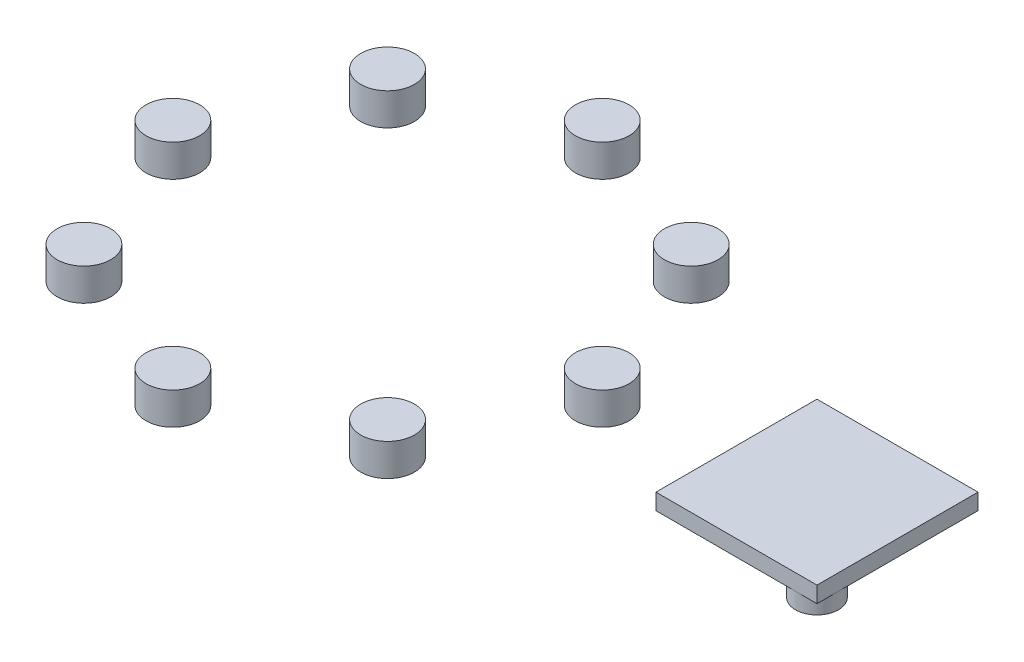
ISO-10303-21;
HEADER;
FILE_DESCRIPTION(('STEP AP214'),'2;1');
FILE_NAME('part.step','',(''),(''),'','','');
FILE_SCHEMA(('AUTOMOTIVE_DESIGN { 1 0 10303 214 1 1 1 1 }'));
ENDSEC;
DATA;
#1=APPLICATION_CONTEXT('core data for automotive mechanical design processes');
#2=APPLICATION_PROTOCOL_DEFINITION('international standard','automotive_design',2000,#1);
#3=PRODUCT_CONTEXT('',#1,'mechanical');
#4=PRODUCT('Part','Part','',(#3));
#5=PRODUCT_RELATED_PRODUCT_CATEGORY('part','',(#4));
#6=PRODUCT_DEFINITION_FORMATION('','',#4);
#7=PRODUCT_DEFINITION_CONTEXT('part definition',#1,'design');
#8=PRODUCT_DEFINITION('design','',#6,#7);
#9=PRODUCT_DEFINITION_SHAPE('','',#8);
#10=(LENGTH_UNIT() NAMED_UNIT(*) SI_UNIT(.MILLI.,.METRE.));
#11=(NAMED_UNIT(*) PLANE_ANGLE_UNIT() SI_UNIT($,.RADIAN.));
#12=(NAMED_UNIT(*) SI_UNIT($,.STERADIAN.) SOLID_ANGLE_UNIT());
#13=UNCERTAINTY_MEASURE_WITH_UNIT(LENGTH_MEASURE(1.E-05),#10,'distance_accuracy_value','');
#14=(GEOMETRIC_REPRESENTATION_CONTEXT(3) GLOBAL_UNCERTAINTY_ASSIGNED_CONTEXT((#13)) GLOBAL_UNIT_ASSIGNED_CONTEXT((#10,
#11,#12)) REPRESENTATION_CONTEXT('',''));
#15=CARTESIAN_POINT('',(0.,0.,0.));
#16=DIRECTION('',(0.,0.,1.));
#17=DIRECTION('',(1.,0.,0.));
#18=AXIS2_PLACEMENT_3D('',#15,#16,#17);
#19=CARTESIAN_POINT('',(-29.1421356237309,3.,14.142135623731));
#20=DIRECTION('',(0.,-1.,0.));
#21=DIRECTION('',(0.,0.,-1.));
#22=AXIS2_PLACEMENT_3D('',#19,#20,#21);
#23=CYLINDRICAL_SURFACE('',#22,2.49999999999999);
#24=CARTESIAN_POINT('',(-29.1421356237309,3.,14.142135623731));
#25=DIRECTION('',(0.,1.,0.));
#26=DIRECTION('',(0.,0.,1.));
#27=AXIS2_PLACEMENT_3D('',#24,#25,#26);
#28=CIRCLE('',#27,2.49999999999999);
#29=CARTESIAN_POINT('',(-29.1421356237309,3.,16.642135623731));
#30=VERTEX_POINT('',#29);
#31=EDGE_CURVE('E79',#30,#30,#28,.T.);
#32=ORIENTED_EDGE('',*,*,#31,.F.);
#33=EDGE_LOOP('',(#32));
#34=FACE_BOUND('',#33,.T.);
#35=CARTESIAN_POINT('',(-29.1421356237309,0.,14.142135623731));
#36=DIRECTION('',(0.,1.,0.));
#37=DIRECTION('',(0.,0.,1.));
#38=AXIS2_PLACEMENT_3D('',#35,#36,#37);
#39=CIRCLE('',#38,2.49999999999999);
#40=CARTESIAN_POINT('',(-29.1421356237309,0.,16.642135623731));
#41=VERTEX_POINT('',#40);
#42=EDGE_CURVE('E12',#41,#41,#39,.T.);
#43=ORIENTED_EDGE('',*,*,#42,.T.);
#44=EDGE_LOOP('',(#43));
#45=FACE_BOUND('',#44,.T.);
#46=ADVANCED_FACE('F75',(#34,#45),#23,.T.);
#47=CARTESIAN_POINT('',(-29.1421356237309,3.,14.142135623731));
#48=DIRECTION('',(0.,1.,0.));
#49=DIRECTION('',(0.,0.,1.));
#50=AXIS2_PLACEMENT_3D('',#47,#48,#49);
#51=PLANE('',#50);
#52=ORIENTED_EDGE('',*,*,#31,.T.);
#53=EDGE_LOOP('',(#52));
#54=FACE_BOUND('',#53,.T.);
#55=ADVANCED_FACE('F77',(#54),#51,.T.);
#56=CARTESIAN_POINT('',(-29.1421356237309,0.,14.142135623731));
#57=DIRECTION('',(0.,1.,0.));
#58=DIRECTION('',(0.,0.,1.));
#59=AXIS2_PLACEMENT_3D('',#56,#57,#58);
#60=PLANE('',#59);
#61=ORIENTED_EDGE('',*,*,#42,.F.);
#62=EDGE_LOOP('',(#61));
#63=FACE_BOUND('',#62,.T.);
#64=ADVANCED_FACE('F94',(#63),#60,.F.);
#65=CLOSED_SHELL('',(#46,#55,#64));
#66=MANIFOLD_SOLID_BREP('B2',#65);
#67=CARTESIAN_POINT('',(-15.,3.,20.));
#68=DIRECTION('',(0.,-1.,0.));
#69=DIRECTION('',(0.,0.,-1.));
#70=AXIS2_PLACEMENT_3D('',#67,#68,#69);
#71=CYLINDRICAL_SURFACE('',#70,2.49999999999999);
#72=CARTESIAN_POINT('',(-15.,3.,20.));
#73=DIRECTION('',(0.,1.,0.));
#74=DIRECTION('',(0.,0.,1.));
#75=AXIS2_PLACEMENT_3D('',#72,#73,#74);
#76=CIRCLE('',#75,2.49999999999999);
#77=CARTESIAN_POINT('',(-15.,3.,22.5));
#78=VERTEX_POINT('',#77);
#79=EDGE_CURVE('E128',#78,#78,#76,.T.);
#80=ORIENTED_EDGE('',*,*,#79,.F.);
#81=EDGE_LOOP('',(#80));
#82=FACE_BOUND('',#81,.T.);
#83=CARTESIAN_POINT('',(-15.,0.,20.));
#84=DIRECTION('',(0.,1.,0.));
#85=DIRECTION('',(0.,0.,1.));
#86=AXIS2_PLACEMENT_3D('',#83,#84,#85);
#87=CIRCLE('',#86,2.49999999999999);
#88=CARTESIAN_POINT('',(-15.,0.,22.5));
#89=VERTEX_POINT('',#88);
#90=EDGE_CURVE('E74',#89,#89,#87,.T.);
#91=ORIENTED_EDGE('',*,*,#90,.T.);
#92=EDGE_LOOP('',(#91));
#93=FACE_BOUND('',#92,.T.);
#94=ADVANCED_FACE('F124',(#82,#93),#71,.T.);
#95=CARTESIAN_POINT('',(-15.,3.,20.));
#96=DIRECTION('',(0.,1.,0.));
#97=DIRECTION('',(0.,0.,1.));
#98=AXIS2_PLACEMENT_3D('',#95,#96,#97);
#99=PLANE('',#98);
#100=ORIENTED_EDGE('',*,*,#79,.T.);
#101=EDGE_LOOP('',(#100));
#102=FACE_BOUND('',#101,.T.);
#103=ADVANCED_FACE('F126',(#102),#99,.T.);
#104=CARTESIAN_POINT('',(-15.,0.,20.));
#105=DIRECTION('',(0.,1.,0.));
#106=DIRECTION('',(0.,0.,1.));
#107=AXIS2_PLACEMENT_3D('',#104,#105,#106);
#108=PLANE('',#107);
#109=ORIENTED_EDGE('',*,*,#90,.F.);
#110=EDGE_LOOP('',(#109));
#111=FACE_BOUND('',#110,.T.);
#112=ADVANCED_FACE('F143',(#111),#108,.F.);
#113=CLOSED_SHELL('',(#94,#103,#112));
#114=MANIFOLD_SOLID_BREP('B7',#113);
#115=CARTESIAN_POINT('',(-0.857864376269023,3.,14.142135623731));
#116=DIRECTION('',(0.,-1.,0.));
#117=DIRECTION('',(0.,0.,-1.));
#118=AXIS2_PLACEMENT_3D('',#115,#116,#117);
#119=CYLINDRICAL_SURFACE('',#118,2.5);
#120=CARTESIAN_POINT('',(-0.857864376269023,3.,14.142135623731));
#121=DIRECTION('',(0.,1.,0.));
#122=DIRECTION('',(0.,0.,1.));
#123=AXIS2_PLACEMENT_3D('',#120,#121,#122);
#124=CIRCLE('',#123,2.5);
#125=CARTESIAN_POINT('',(-0.857864376269023,3.,16.642135623731));
#126=VERTEX_POINT('',#125);
#127=EDGE_CURVE('E177',#126,#126,#124,.T.);
#128=ORIENTED_EDGE('',*,*,#127,.F.);
#129=EDGE_LOOP('',(#128));
#130=FACE_BOUND('',#129,.T.);
#131=CARTESIAN_POINT('',(-0.857864376269023,0.,14.142135623731));
#132=DIRECTION('',(0.,1.,0.));
#133=DIRECTION('',(0.,0.,1.));
#134=AXIS2_PLACEMENT_3D('',#131,#132,#133);
#135=CIRCLE('',#134,2.5);
#136=CARTESIAN_POINT('',(-0.857864376269023,0.,16.642135623731));
#137=VERTEX_POINT('',#136);
#138=EDGE_CURVE('E123',#137,#137,#135,.T.);
#139=ORIENTED_EDGE('',*,*,#138,.T.);
#140=EDGE_LOOP('',(#139));
#141=FACE_BOUND('',#140,.T.);
#142=ADVANCED_FACE('F173',(#130,#141),#119,.T.);
#143=CARTESIAN_POINT('',(-0.857864376269023,3.,14.142135623731));
#144=DIRECTION('',(0.,1.,0.));
#145=DIRECTION('',(0.,0.,1.));
#146=AXIS2_PLACEMENT_3D('',#143,#144,#145);
#147=PLANE('',#146);
#148=ORIENTED_EDGE('',*,*,#127,.T.);
#149=EDGE_LOOP('',(#148));
#150=FACE_BOUND('',#149,.T.);
#151=ADVANCED_FACE('F175',(#150),#147,.T.);
#152=CARTESIAN_POINT('',(-0.857864376269023,0.,14.142135623731));
#153=DIRECTION('',(0.,1.,0.));
#154=DIRECTION('',(0.,0.,1.));
#155=AXIS2_PLACEMENT_3D('',#152,#153,#154);
#156=PLANE('',#155);
#157=ORIENTED_EDGE('',*,*,#138,.F.);
#158=EDGE_LOOP('',(#157));
#159=FACE_BOUND('',#158,.T.);
#160=ADVANCED_FACE('F192',(#159),#156,.F.);
#161=CLOSED_SHELL('',(#142,#151,#160));
#162=MANIFOLD_SOLID_BREP('B69',#161);
#163=CARTESIAN_POINT('',(5.00000000000001,3.,0.));
#164=DIRECTION('',(0.,-1.,0.));
#165=DIRECTION('',(0.,0.,-1.));
#166=AXIS2_PLACEMENT_3D('',#163,#164,#165);
#167=CYLINDRICAL_SURFACE('',#166,2.5);
#168=CARTESIAN_POINT('',(5.00000000000001,3.,0.));
#169=DIRECTION('',(0.,1.,0.));
#170=DIRECTION('',(0.,0.,1.));
#171=AXIS2_PLACEMENT_3D('',#168,#169,#170);
#172=CIRCLE('',#171,2.5);
#173=CARTESIAN_POINT('',(5.00000000000001,3.,2.5));
#174=VERTEX_POINT('',#173);
#175=EDGE_CURVE('E226',#174,#174,#172,.T.);
#176=ORIENTED_EDGE('',*,*,#175,.F.);
#177=EDGE_LOOP('',(#176));
#178=FACE_BOUND('',#177,.T.);
#179=CARTESIAN_POINT('',(5.00000000000001,0.,0.));
#180=DIRECTION('',(0.,1.,0.));
#181=DIRECTION('',(0.,0.,1.));
#182=AXIS2_PLACEMENT_3D('',#179,#180,#181);
#183=CIRCLE('',#182,2.5);
#184=CARTESIAN_POINT('',(5.00000000000001,0.,2.5));
#185=VERTEX_POINT('',#184);
#186=EDGE_CURVE('E172',#185,#185,#183,.T.);
#187=ORIENTED_EDGE('',*,*,#186,.T.);
#188=EDGE_LOOP('',(#187));
#189=FACE_BOUND('',#188,.T.);
#190=ADVANCED_FACE('F222',(#178,#189),#167,.T.);
#191=CARTESIAN_POINT('',(5.00000000000001,3.,0.));
#192=DIRECTION('',(0.,1.,0.));
#193=DIRECTION('',(0.,0.,1.));
#194=AXIS2_PLACEMENT_3D('',#191,#192,#193);
#195=PLANE('',#194);
#196=ORIENTED_EDGE('',*,*,#175,.T.);
#197=EDGE_LOOP('',(#196));
#198=FACE_BOUND('',#197,.T.);
#199=ADVANCED_FACE('F224',(#198),#195,.T.);
#200=CARTESIAN_POINT('',(5.00000000000001,0.,0.));
#201=DIRECTION('',(0.,1.,0.));
#202=DIRECTION('',(0.,0.,1.));
#203=AXIS2_PLACEMENT_3D('',#200,#201,#202);
#204=PLANE('',#203);
#205=ORIENTED_EDGE('',*,*,#186,.F.);
#206=EDGE_LOOP('',(#205));
#207=FACE_BOUND('',#206,.T.);
#208=ADVANCED_FACE('F241',(#207),#204,.F.);
#209=CLOSED_SHELL('',(#190,#199,#208));
#210=MANIFOLD_SOLID_BREP('B118',#209);
#211=CARTESIAN_POINT('',(-0.857864376269051,3.,-14.1421356237309));
#212=DIRECTION('',(0.,-1.,0.));
#213=DIRECTION('',(0.,0.,-1.));
#214=AXIS2_PLACEMENT_3D('',#211,#212,#213);
#215=CYLINDRICAL_SURFACE('',#214,2.5);
#216=CARTESIAN_POINT('',(-0.857864376269051,3.,-14.1421356237309));
#217=DIRECTION('',(0.,1.,0.));
#218=DIRECTION('',(0.,0.,1.));
#219=AXIS2_PLACEMENT_3D('',#216,#217,#218);
#220=CIRCLE('',#219,2.5);
#221=CARTESIAN_POINT('',(-0.857864376269051,3.,-11.6421356237309));
#222=VERTEX_POINT('',#221);
#223=EDGE_CURVE('E275',#222,#222,#220,.T.);
#224=ORIENTED_EDGE('',*,*,#223,.F.);
#225=EDGE_LOOP('',(#224));
#226=FACE_BOUND('',#225,.T.);
#227=CARTESIAN_POINT('',(-0.857864376269051,0.,-14.1421356237309));
#228=DIRECTION('',(0.,1.,0.));
#229=DIRECTION('',(0.,0.,1.));
#230=AXIS2_PLACEMENT_3D('',#227,#228,#229);
#231=CIRCLE('',#230,2.5);
#232=CARTESIAN_POINT('',(-0.857864376269051,0.,-11.6421356237309));
#233=VERTEX_POINT('',#232);
#234=EDGE_CURVE('E221',#233,#233,#231,.T.);
#235=ORIENTED_EDGE('',*,*,#234,.T.);
#236=EDGE_LOOP('',(#235));
#237=FACE_BOUND('',#236,.T.);
#238=ADVANCED_FACE('F271',(#226,#237),#215,.T.);
#239=CARTESIAN_POINT('',(-0.857864376269051,3.,-14.1421356237309));
#240=DIRECTION('',(0.,1.,0.));
#241=DIRECTION('',(0.,0.,1.));
#242=AXIS2_PLACEMENT_3D('',#239,#240,#241);
#243=PLANE('',#242);
#244=ORIENTED_EDGE('',*,*,#223,.T.);
#245=EDGE_LOOP('',(#244));
#246=FACE_BOUND('',#245,.T.);
#247=ADVANCED_FACE('F273',(#246),#243,.T.);
#248=CARTESIAN_POINT('',(-0.857864376269051,0.,-14.1421356237309));
#249=DIRECTION('',(0.,1.,0.));
#250=DIRECTION('',(0.,0.,1.));
#251=AXIS2_PLACEMENT_3D('',#248,#249,#250);
#252=PLANE('',#251);
#253=ORIENTED_EDGE('',*,*,#234,.F.);
#254=EDGE_LOOP('',(#253));
#255=FACE_BOUND('',#254,.T.);
#256=ADVANCED_FACE('F290',(#255),#252,.F.);
#257=CLOSED_SHELL('',(#238,#247,#256));
#258=MANIFOLD_SOLID_BREP('B167',#257);
#259=CARTESIAN_POINT('',(-15.,3.,-20.));
#260=DIRECTION('',(0.,-1.,0.));
#261=DIRECTION('',(0.,0.,-1.));
#262=AXIS2_PLACEMENT_3D('',#259,#260,#261);
#263=CYLINDRICAL_SURFACE('',#262,2.49999999999999);
#264=CARTESIAN_POINT('',(-15.,3.,-20.));
#265=DIRECTION('',(0.,1.,0.));
#266=DIRECTION('',(0.,0.,1.));
#267=AXIS2_PLACEMENT_3D('',#264,#265,#266);
#268=CIRCLE('',#267,2.49999999999999);
#269=CARTESIAN_POINT('',(-15.,3.,-17.5));
#270=VERTEX_POINT('',#269);
#271=EDGE_CURVE('E324',#270,#270,#268,.T.);
#272=ORIENTED_EDGE('',*,*,#271,.F.);
#273=EDGE_LOOP('',(#272));
#274=FACE_BOUND('',#273,.T.);
#275=CARTESIAN_POINT('',(-15.,0.,-20.));
#276=DIRECTION('',(0.,1.,0.));
#277=DIRECTION('',(0.,0.,1.));
#278=AXIS2_PLACEMENT_3D('',#275,#276,#277);
#279=CIRCLE('',#278,2.49999999999999);
#280=CARTESIAN_POINT('',(-15.,0.,-17.5));
#281=VERTEX_POINT('',#280);
#282=EDGE_CURVE('E270',#281,#281,#279,.T.);
#283=ORIENTED_EDGE('',*,*,#282,.T.);
#284=EDGE_LOOP('',(#283));
#285=FACE_BOUND('',#284,.T.);
#286=ADVANCED_FACE('F320',(#274,#285),#263,.T.);
#287=CARTESIAN_POINT('',(-15.,3.,-20.));
#288=DIRECTION('',(0.,1.,0.));
#289=DIRECTION('',(0.,0.,1.));
#290=AXIS2_PLACEMENT_3D('',#287,#288,#289);
#291=PLANE('',#290);
#292=ORIENTED_EDGE('',*,*,#271,.T.);
#293=EDGE_LOOP('',(#292));
#294=FACE_BOUND('',#293,.T.);
#295=ADVANCED_FACE('F322',(#294),#291,.T.);
#296=CARTESIAN_POINT('',(-15.,0.,-20.));
#297=DIRECTION('',(0.,1.,0.));
#298=DIRECTION('',(0.,0.,1.));
#299=AXIS2_PLACEMENT_3D('',#296,#297,#298);
#300=PLANE('',#299);
#301=ORIENTED_EDGE('',*,*,#282,.F.);
#302=EDGE_LOOP('',(#301));
#303=FACE_BOUND('',#302,.T.);
#304=ADVANCED_FACE('F339',(#303),#300,.F.);
#305=CLOSED_SHELL('',(#286,#295,#304));
#306=MANIFOLD_SOLID_BREP('B216',#305);
#307=CARTESIAN_POINT('',(-29.1421356237309,3.,-14.1421356237309));
#308=DIRECTION('',(0.,-1.,0.));
#309=DIRECTION('',(0.,0.,-1.));
#310=AXIS2_PLACEMENT_3D('',#307,#308,#309);
#311=CYLINDRICAL_SURFACE('',#310,2.49999999999999);
#312=CARTESIAN_POINT('',(-29.1421356237309,3.,-14.1421356237309));
#313=DIRECTION('',(0.,1.,0.));
#314=DIRECTION('',(0.,0.,1.));
#315=AXIS2_PLACEMENT_3D('',#312,#313,#314);
#316=CIRCLE('',#315,2.49999999999999);
#317=CARTESIAN_POINT('',(-29.1421356237309,3.,-11.6421356237309));
#318=VERTEX_POINT('',#317);
#319=EDGE_CURVE('E375',#318,#318,#316,.T.);
#320=ORIENTED_EDGE('',*,*,#319,.F.);
#321=EDGE_LOOP('',(#320));
#322=FACE_BOUND('',#321,.T.);
#323=CARTESIAN_POINT('',(-29.1421356237309,0.,-14.1421356237309));
#324=DIRECTION('',(0.,1.,0.));
#325=DIRECTION('',(0.,0.,1.));
#326=AXIS2_PLACEMENT_3D('',#323,#324,#325);
#327=CIRCLE('',#326,2.49999999999999);
#328=CARTESIAN_POINT('',(-29.1421356237309,0.,-11.6421356237309));
#329=VERTEX_POINT('',#328);
#330=EDGE_CURVE('E319',#329,#329,#327,.T.);
#331=ORIENTED_EDGE('',*,*,#330,.T.);
#332=EDGE_LOOP('',(#331));
#333=FACE_BOUND('',#332,.T.);
#334=ADVANCED_FACE('F371',(#322,#333),#311,.T.);
#335=CARTESIAN_POINT('',(0.,3.,0.));
#336=DIRECTION('',(0.,1.,0.));
#337=DIRECTION('',(0.,0.,1.));
#338=AXIS2_PLACEMENT_3D('',#335,#336,#337);
#339=PLANE('',#338);
#340=ORIENTED_EDGE('',*,*,#319,.T.);
#341=EDGE_LOOP('',(#340));
#342=FACE_BOUND('',#341,.T.);
#343=ADVANCED_FACE('F373',(#342),#339,.T.);
#344=CARTESIAN_POINT('',(0.,0.,0.));
#345=DIRECTION('',(0.,1.,0.));
#346=DIRECTION('',(0.,0.,1.));
#347=AXIS2_PLACEMENT_3D('',#344,#345,#346);
#348=PLANE('',#347);
#349=ORIENTED_EDGE('',*,*,#330,.F.);
#350=EDGE_LOOP('',(#349));
#351=FACE_BOUND('',#350,.T.);
#352=ADVANCED_FACE('F390',(#351),#348,.F.);
#353=CLOSED_SHELL('',(#334,#343,#352));
#354=MANIFOLD_SOLID_BREP('B265',#353);
#355=CARTESIAN_POINT('',(0.,3.,7.5));
#356=DIRECTION('',(0.,0.,1.));
#357=DIRECTION('',(1.,0.,0.));
#358=AXIS2_PLACEMENT_3D('',#355,#356,#357);
#359=PLANE('',#358);
#360=DIRECTION('',(-1.,0.,0.));
#361=VECTOR('',#360,1.);
#362=CARTESIAN_POINT('',(0.,1.5,7.5));
#363=LINE('',#362,#361);
#364=CARTESIAN_POINT('',(30.5,1.5,7.5));
#365=VERTEX_POINT('',#364);
#366=CARTESIAN_POINT('',(17.5,1.5,7.5));
#367=VERTEX_POINT('',#366);
#368=EDGE_CURVE('E488',#365,#367,#363,.T.);
#369=ORIENTED_EDGE('',*,*,#368,.F.);
#370=DIRECTION('',(1.,0.,0.));
#371=VECTOR('',#370,1.);
#372=CARTESIAN_POINT('',(32.5,1.5,7.5));
#373=LINE('',#372,#371);
#374=CARTESIAN_POINT('',(32.5,1.5,7.5));
#375=VERTEX_POINT('',#374);
#376=EDGE_CURVE('E478',#365,#375,#373,.T.);
#377=ORIENTED_EDGE('',*,*,#376,.T.);
#378=DIRECTION('',(0.,-1.,0.));
#379=VECTOR('',#378,1.);
#380=CARTESIAN_POINT('',(32.5,3.,7.5));
#381=LINE('',#380,#379);
#382=CARTESIAN_POINT('',(32.5,3.,7.5));
#383=VERTEX_POINT('',#382);
#384=EDGE_CURVE('E442',#383,#375,#381,.T.);
#385=ORIENTED_EDGE('',*,*,#384,.F.);
#386=DIRECTION('',(-1.,0.,0.));
#387=VECTOR('',#386,1.);
#388=CARTESIAN_POINT('',(0.,3.,7.5));
#389=LINE('',#388,#387);
#390=CARTESIAN_POINT('',(17.5,3.,7.5));
#391=VERTEX_POINT('',#390);
#392=EDGE_CURVE('E428',#383,#391,#389,.T.);
#393=ORIENTED_EDGE('',*,*,#392,.T.);
#394=DIRECTION('',(0.,-1.,0.));
#395=VECTOR('',#394,1.);
#396=CARTESIAN_POINT('',(17.5,3.,7.5));
#397=LINE('',#396,#395);
#398=EDGE_CURVE('E434',#391,#367,#397,.T.);
#399=ORIENTED_EDGE('',*,*,#398,.T.);
#400=EDGE_LOOP('',(#369,#377,#385,#393,#399));
#401=FACE_BOUND('',#400,.T.);
#402=ADVANCED_FACE('F419',(#401),#359,.T.);
#403=CARTESIAN_POINT('',(32.5,3.,0.));
#404=DIRECTION('',(-1.,0.,0.));
#405=DIRECTION('',(0.,0.,1.));
#406=AXIS2_PLACEMENT_3D('',#403,#404,#405);
#407=PLANE('',#406);
#408=DIRECTION('',(0.,0.,-1.));
#409=VECTOR('',#408,1.);
#410=CARTESIAN_POINT('',(32.5,1.5,5.5));
#411=LINE('',#410,#409);
#412=CARTESIAN_POINT('',(32.5,1.5,5.5));
#413=VERTEX_POINT('',#412);
#414=EDGE_CURVE('E476',#375,#413,#411,.T.);
#415=ORIENTED_EDGE('',*,*,#414,.T.);
#416=DIRECTION('',(0.,0.,1.));
#417=VECTOR('',#416,1.);
#418=CARTESIAN_POINT('',(32.5,1.5,0.));
#419=LINE('',#418,#417);
#420=CARTESIAN_POINT('',(32.5,1.5,-7.5));
#421=VERTEX_POINT('',#420);
#422=EDGE_CURVE('E503',#421,#413,#419,.T.);
#423=ORIENTED_EDGE('',*,*,#422,.F.);
#424=DIRECTION('',(0.,-1.,0.));
#425=VECTOR('',#424,1.);
#426=CARTESIAN_POINT('',(32.5,3.,-7.5));
#427=LINE('',#426,#425);
#428=CARTESIAN_POINT('',(32.5,3.,-7.5));
#429=VERTEX_POINT('',#428);
#430=EDGE_CURVE('E496',#429,#421,#427,.T.);
#431=ORIENTED_EDGE('',*,*,#430,.F.);
#432=DIRECTION('',(0.,0.,-1.));
#433=VECTOR('',#432,1.);
#434=CARTESIAN_POINT('',(32.5,3.,0.));
#435=LINE('',#434,#433);
#436=EDGE_CURVE('E493',#383,#429,#435,.T.);
#437=ORIENTED_EDGE('',*,*,#436,.F.);
#438=ORIENTED_EDGE('',*,*,#384,.T.);
#439=EDGE_LOOP('',(#415,#423,#431,#437,#438));
#440=FACE_BOUND('',#439,.T.);
#441=ADVANCED_FACE('F491',(#440),#407,.F.);
#442=CARTESIAN_POINT('',(0.,0.,0.));
#443=DIRECTION('',(0.,1.,0.));
#444=DIRECTION('',(0.,0.,1.));
#445=AXIS2_PLACEMENT_3D('',#442,#443,#444);
#446=PLANE('',#445);
#447=CARTESIAN_POINT('',(19.5,0.,-5.5));
#448=DIRECTION('',(0.,-1.,0.));
#449=DIRECTION('',(0.,0.,-1.));
#450=AXIS2_PLACEMENT_3D('',#447,#448,#449);
#451=CIRCLE('',#450,2.);
#452=CARTESIAN_POINT('',(19.5,0.,-7.5));
#453=VERTEX_POINT('',#452);
#454=EDGE_CURVE('E537',#453,#453,#451,.T.);
#455=ORIENTED_EDGE('',*,*,#454,.T.);
#456=EDGE_LOOP('',(#455));
#457=FACE_BOUND('',#456,.T.);
#458=ADVANCED_FACE('F562',(#457),#446,.F.);
#459=CARTESIAN_POINT('',(17.5,3.,0.));
#460=DIRECTION('',(-1.,0.,0.));
#461=DIRECTION('',(0.,0.,1.));
#462=AXIS2_PLACEMENT_3D('',#459,#460,#461);
#463=PLANE('',#462);
#464=DIRECTION('',(0.,-1.,0.));
#465=VECTOR('',#464,1.);
#466=CARTESIAN_POINT('',(17.5,3.,-7.5));
#467=LINE('',#466,#465);
#468=CARTESIAN_POINT('',(17.5,3.,-7.5));
#469=VERTEX_POINT('',#468);
#470=CARTESIAN_POINT('',(17.5,1.5,-7.5));
#471=VERTEX_POINT('',#470);
#472=EDGE_CURVE('E501',#469,#471,#467,.T.);
#473=ORIENTED_EDGE('',*,*,#472,.T.);
#474=DIRECTION('',(0.,0.,-1.));
#475=VECTOR('',#474,1.);
#476=CARTESIAN_POINT('',(17.5,1.5,0.));
#477=LINE('',#476,#475);
#478=CARTESIAN_POINT('',(17.5,1.5,-5.5));
#479=VERTEX_POINT('',#478);
#480=EDGE_CURVE('E520',#479,#471,#477,.T.);
#481=ORIENTED_EDGE('',*,*,#480,.F.);
#482=DIRECTION('',(0.,0.,-1.));
#483=VECTOR('',#482,1.);
#484=CARTESIAN_POINT('',(17.5,1.5,0.));
#485=LINE('',#484,#483);
#486=EDGE_CURVE('E547',#367,#479,#485,.T.);
#487=ORIENTED_EDGE('',*,*,#486,.F.);
#488=ORIENTED_EDGE('',*,*,#398,.F.);
#489=DIRECTION('',(0.,0.,-1.));
#490=VECTOR('',#489,1.);
#491=CARTESIAN_POINT('',(17.5,3.,0.));
#492=LINE('',#491,#490);
#493=EDGE_CURVE('E369',#391,#469,#492,.T.);
#494=ORIENTED_EDGE('',*,*,#493,.T.);
#495=EDGE_LOOP('',(#473,#481,#487,#488,#494));
#496=FACE_BOUND('',#495,.T.);
#497=ADVANCED_FACE('F518',(#496),#463,.T.);
#498=CARTESIAN_POINT('',(0.,3.,-7.5));
#499=DIRECTION('',(0.,0.,1.));
#500=DIRECTION('',(1.,0.,0.));
#501=AXIS2_PLACEMENT_3D('',#498,#499,#500);
#502=PLANE('',#501);
#503=DIRECTION('',(1.,0.,0.));
#504=VECTOR('',#503,1.);
#505=CARTESIAN_POINT('',(0.,1.5,-7.5));
#506=LINE('',#505,#504);
#507=CARTESIAN_POINT('',(19.5,1.5,-7.5));
#508=VERTEX_POINT('',#507);
#509=EDGE_CURVE('E527',#471,#508,#506,.T.);
#510=ORIENTED_EDGE('',*,*,#509,.F.);
#511=ORIENTED_EDGE('',*,*,#472,.F.);
#512=DIRECTION('',(-1.,0.,0.));
#513=VECTOR('',#512,1.);
#514=CARTESIAN_POINT('',(0.,3.,-7.5));
#515=LINE('',#514,#513);
#516=EDGE_CURVE('E510',#429,#469,#515,.T.);
#517=ORIENTED_EDGE('',*,*,#516,.F.);
#518=ORIENTED_EDGE('',*,*,#430,.T.);
#519=DIRECTION('',(1.,0.,0.));
#520=VECTOR('',#519,1.);
#521=CARTESIAN_POINT('',(0.,1.5,-7.5));
#522=LINE('',#521,#520);
#523=EDGE_CURVE('E528',#508,#421,#522,.T.);
#524=ORIENTED_EDGE('',*,*,#523,.F.);
#525=EDGE_LOOP('',(#510,#511,#517,#518,#524));
#526=FACE_BOUND('',#525,.T.);
#527=ADVANCED_FACE('F524',(#526),#502,.F.);
#528=CARTESIAN_POINT('',(30.5,0.,5.5));
#529=DIRECTION('',(0.,-1.,0.));
#530=DIRECTION('',(0.,0.,-1.));
#531=AXIS2_PLACEMENT_3D('',#528,#529,#530);
#532=CIRCLE('',#531,2.00000000000001);
#533=CARTESIAN_POINT('',(30.5,0.,3.49999999999999));
#534=VERTEX_POINT('',#533);
#535=EDGE_CURVE('E532',#534,#534,#532,.T.);
#536=ORIENTED_EDGE('',*,*,#535,.T.);
#537=EDGE_LOOP('',(#536));
#538=FACE_BOUND('',#537,.T.);
#539=ADVANCED_FACE('F592',(#538),#446,.F.);
#540=CARTESIAN_POINT('',(0.,3.,0.));
#541=DIRECTION('',(0.,1.,0.));
#542=DIRECTION('',(0.,0.,1.));
#543=AXIS2_PLACEMENT_3D('',#540,#541,#542);
#544=PLANE('',#543);
#545=ORIENTED_EDGE('',*,*,#493,.F.);
#546=ORIENTED_EDGE('',*,*,#392,.F.);
#547=ORIENTED_EDGE('',*,*,#436,.T.);
#548=ORIENTED_EDGE('',*,*,#516,.T.);
#549=EDGE_LOOP('',(#545,#546,#547,#548));
#550=FACE_BOUND('',#549,.T.);
#551=ADVANCED_FACE('F421',(#550),#544,.T.);
#552=CARTESIAN_POINT('',(30.5,1.5,5.5));
#553=DIRECTION('',(0.,-1.,0.));
#554=DIRECTION('',(0.,0.,-1.));
#555=AXIS2_PLACEMENT_3D('',#552,#553,#554);
#556=CYLINDRICAL_SURFACE('',#555,2.00000000000001);
#557=ORIENTED_EDGE('',*,*,#535,.F.);
#558=EDGE_LOOP('',(#557));
#559=FACE_BOUND('',#558,.T.);
#560=CARTESIAN_POINT('',(30.5,1.5,5.5));
#561=DIRECTION('',(0.,-1.,0.));
#562=DIRECTION('',(0.,0.,-1.));
#563=AXIS2_PLACEMENT_3D('',#560,#561,#562);
#564=CIRCLE('',#563,2.);
#565=EDGE_CURVE('E480',#413,#365,#564,.T.);
#566=ORIENTED_EDGE('',*,*,#565,.T.);
#567=CARTESIAN_POINT('',(30.5,1.5,5.5));
#568=DIRECTION('',(0.,-1.,0.));
#569=DIRECTION('',(0.,0.,-1.));
#570=AXIS2_PLACEMENT_3D('',#567,#568,#569);
#571=CIRCLE('',#570,2.00000000000001);
#572=EDGE_CURVE('E542',#365,#413,#571,.T.);
#573=ORIENTED_EDGE('',*,*,#572,.T.);
#574=EDGE_LOOP('',(#566,#573));
#575=FACE_BOUND('',#574,.T.);
#576=ADVANCED_FACE('F568',(#559,#575),#556,.T.);
#577=CARTESIAN_POINT('',(19.5,1.5,-5.5));
#578=DIRECTION('',(0.,-1.,0.));
#579=DIRECTION('',(0.,0.,-1.));
#580=AXIS2_PLACEMENT_3D('',#577,#578,#579);
#581=CYLINDRICAL_SURFACE('',#580,2.);
#582=ORIENTED_EDGE('',*,*,#454,.F.);
#583=EDGE_LOOP('',(#582));
#584=FACE_BOUND('',#583,.T.);
#585=CARTESIAN_POINT('',(19.5,1.5,-5.5));
#586=DIRECTION('',(0.,-1.,0.));
#587=DIRECTION('',(0.,0.,-1.));
#588=AXIS2_PLACEMENT_3D('',#585,#586,#587);
#589=CIRCLE('',#588,2.);
#590=EDGE_CURVE('E485',#479,#508,#589,.T.);
#591=ORIENTED_EDGE('',*,*,#590,.T.);
#592=CARTESIAN_POINT('',(19.5,1.5,-5.5));
#593=DIRECTION('',(0.,-1.,0.));
#594=DIRECTION('',(0.,0.,-1.));
#595=AXIS2_PLACEMENT_3D('',#592,#593,#594);
#596=CIRCLE('',#595,2.);
#597=EDGE_CURVE('E551',#508,#479,#596,.T.);
#598=ORIENTED_EDGE('',*,*,#597,.T.);
#599=EDGE_LOOP('',(#591,#598));
#600=FACE_BOUND('',#599,.T.);
#601=ADVANCED_FACE('F564',(#584,#600),#581,.T.);
#602=CARTESIAN_POINT('',(0.,1.5,0.));
#603=DIRECTION('',(0.,-1.,0.));
#604=DIRECTION('',(0.,0.,-1.));
#605=AXIS2_PLACEMENT_3D('',#602,#603,#604);
#606=PLANE('',#605);
#607=ORIENTED_EDGE('',*,*,#572,.F.);
#608=ORIENTED_EDGE('',*,*,#368,.T.);
#609=ORIENTED_EDGE('',*,*,#486,.T.);
#610=ORIENTED_EDGE('',*,*,#597,.F.);
#611=ORIENTED_EDGE('',*,*,#523,.T.);
#612=ORIENTED_EDGE('',*,*,#422,.T.);
#613=EDGE_LOOP('',(#607,#608,#609,#610,#611,#612));
#614=FACE_BOUND('',#613,.T.);
#615=ADVANCED_FACE('F567',(#614),#606,.T.);
#616=CARTESIAN_POINT('',(0.,1.5,0.));
#617=DIRECTION('',(0.,-1.,0.));
#618=DIRECTION('',(0.,0.,-1.));
#619=AXIS2_PLACEMENT_3D('',#616,#617,#618);
#620=PLANE('',#619);
#621=ORIENTED_EDGE('',*,*,#590,.F.);
#622=ORIENTED_EDGE('',*,*,#480,.T.);
#623=ORIENTED_EDGE('',*,*,#509,.T.);
#624=EDGE_LOOP('',(#621,#622,#623));
#625=FACE_BOUND('',#624,.T.);
#626=ADVANCED_FACE('F576',(#625),#620,.T.);
#627=CARTESIAN_POINT('',(0.,1.5,0.));
#628=DIRECTION('',(0.,-1.,0.));
#629=DIRECTION('',(0.,0.,-1.));
#630=AXIS2_PLACEMENT_3D('',#627,#628,#629);
#631=PLANE('',#630);
#632=ORIENTED_EDGE('',*,*,#565,.F.);
#633=ORIENTED_EDGE('',*,*,#414,.F.);
#634=ORIENTED_EDGE('',*,*,#376,.F.);
#635=EDGE_LOOP('',(#632,#633,#634));
#636=FACE_BOUND('',#635,.T.);
#637=ADVANCED_FACE('F477',(#636),#631,.T.);
#638=CLOSED_SHELL('',(#402,#441,#458,#497,#527,#539,#551,#576,#601,#615,#626,#637));
#639=MANIFOLD_SOLID_BREP('B314',#638);
#640=CARTESIAN_POINT('',(-35.,3.,0.));
#641=DIRECTION('',(0.,-1.,0.));
#642=DIRECTION('',(0.,0.,-1.));
#643=AXIS2_PLACEMENT_3D('',#640,#641,#642);
#644=CYLINDRICAL_SURFACE('',#643,2.49999999999999);
#645=CARTESIAN_POINT('',(-35.,3.,0.));
#646=DIRECTION('',(0.,1.,0.));
#647=DIRECTION('',(0.,0.,1.));
#648=AXIS2_PLACEMENT_3D('',#645,#646,#647);
#649=CIRCLE('',#648,2.49999999999999);
#650=CARTESIAN_POINT('',(-35.,3.,2.50000000000003));
#651=VERTEX_POINT('',#650);
#652=EDGE_CURVE('E418',#651,#651,#649,.T.);
#653=ORIENTED_EDGE('',*,*,#652,.F.);
#654=EDGE_LOOP('',(#653));
#655=FACE_BOUND('',#654,.T.);
#656=CARTESIAN_POINT('',(-35.,0.,0.));
#657=DIRECTION('',(0.,1.,0.));
#658=DIRECTION('',(0.,0.,1.));
#659=AXIS2_PLACEMENT_3D('',#656,#657,#658);
#660=CIRCLE('',#659,2.49999999999999);
#661=CARTESIAN_POINT('',(-35.,0.,2.50000000000003));
#662=VERTEX_POINT('',#661);
#663=EDGE_CURVE('E686',#662,#662,#660,.T.);
#664=ORIENTED_EDGE('',*,*,#663,.T.);
#665=EDGE_LOOP('',(#664));
#666=FACE_BOUND('',#665,.T.);
#667=ADVANCED_FACE('F683',(#655,#666),#644,.T.);
#668=CARTESIAN_POINT('',(0.,3.,0.));
#669=DIRECTION('',(0.,1.,0.));
#670=DIRECTION('',(0.,0.,1.));
#671=AXIS2_PLACEMENT_3D('',#668,#669,#670);
#672=PLANE('',#671);
#673=ORIENTED_EDGE('',*,*,#652,.T.);
#674=EDGE_LOOP('',(#673));
#675=FACE_BOUND('',#674,.T.);
#676=ADVANCED_FACE('F698',(#675),#672,.T.);
#677=CARTESIAN_POINT('',(0.,0.,0.));
#678=DIRECTION('',(0.,1.,0.));
#679=DIRECTION('',(0.,0.,1.));
#680=AXIS2_PLACEMENT_3D('',#677,#678,#679);
#681=PLANE('',#680);
#682=ORIENTED_EDGE('',*,*,#663,.F.);
#683=EDGE_LOOP('',(#682));
#684=FACE_BOUND('',#683,.T.);
#685=ADVANCED_FACE('F696',(#684),#681,.F.);
#686=CLOSED_SHELL('',(#667,#676,#685));
#687=MANIFOLD_SOLID_BREP('B363',#686);
#688=ADVANCED_BREP_SHAPE_REPRESENTATION('',(#18,#66,#114,#162,#210,#258,#306,#354,#639,#687),#14);
#689=SHAPE_DEFINITION_REPRESENTATION(#9,#688);
ENDSEC;
END-ISO-10303-21;
